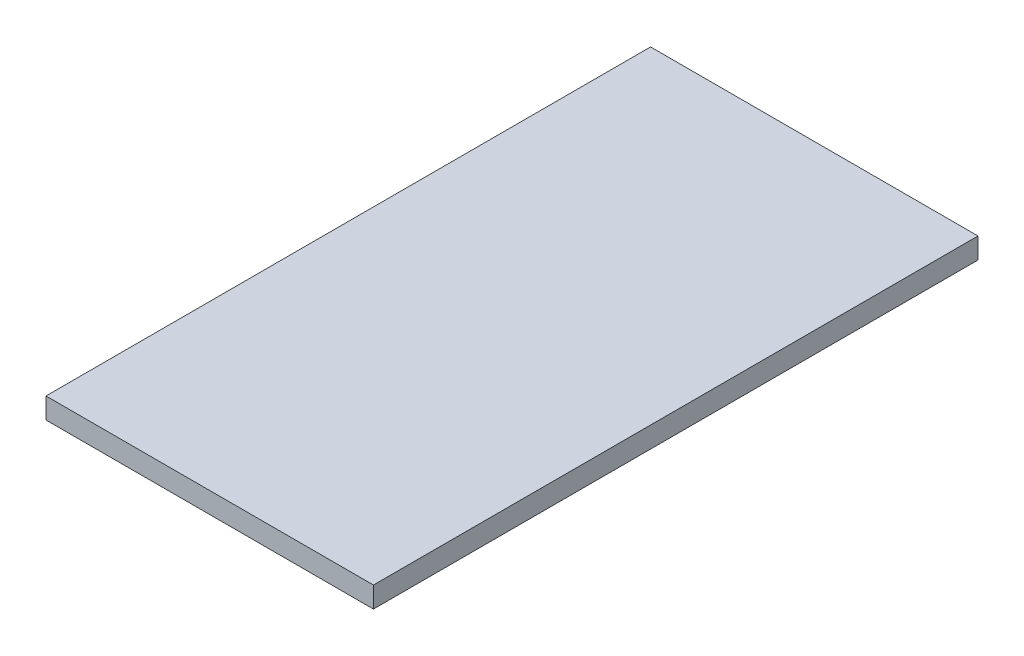
ISO-10303-21;
HEADER;
FILE_DESCRIPTION(('STEP AP214'),'2;1');
FILE_NAME('part.step','',(''),(''),'','','');
FILE_SCHEMA(('AUTOMOTIVE_DESIGN { 1 0 10303 214 1 1 1 1 }'));
ENDSEC;
DATA;
#1=APPLICATION_CONTEXT('core data for automotive mechanical design processes');
#2=APPLICATION_PROTOCOL_DEFINITION('international standard','automotive_design',2000,#1);
#3=PRODUCT_CONTEXT('',#1,'mechanical');
#4=PRODUCT('Part','Part','',(#3));
#5=PRODUCT_RELATED_PRODUCT_CATEGORY('part','',(#4));
#6=PRODUCT_DEFINITION_FORMATION('','',#4);
#7=PRODUCT_DEFINITION_CONTEXT('part definition',#1,'design');
#8=PRODUCT_DEFINITION('design','',#6,#7);
#9=PRODUCT_DEFINITION_SHAPE('','',#8);
#10=(LENGTH_UNIT() NAMED_UNIT(*) SI_UNIT(.MILLI.,.METRE.));
#11=(NAMED_UNIT(*) PLANE_ANGLE_UNIT() SI_UNIT($,.RADIAN.));
#12=(NAMED_UNIT(*) SI_UNIT($,.STERADIAN.) SOLID_ANGLE_UNIT());
#13=UNCERTAINTY_MEASURE_WITH_UNIT(LENGTH_MEASURE(1.E-05),#10,'distance_accuracy_value','');
#14=(GEOMETRIC_REPRESENTATION_CONTEXT(3) GLOBAL_UNCERTAINTY_ASSIGNED_CONTEXT((#13)) GLOBAL_UNIT_ASSIGNED_CONTEXT((#10,
#11,#12)) REPRESENTATION_CONTEXT('',''));
#15=CARTESIAN_POINT('',(0.,0.,0.));
#16=DIRECTION('',(0.,0.,1.));
#17=DIRECTION('',(1.,0.,0.));
#18=AXIS2_PLACEMENT_3D('',#15,#16,#17);
#19=CARTESIAN_POINT('',(0.,-19.05,0.));
#20=DIRECTION('',(0.,0.,1.));
#21=DIRECTION('',(1.,0.,0.));
#22=AXIS2_PLACEMENT_3D('',#19,#20,#21);
#23=PLANE('',#22);
#24=DIRECTION('',(1.,0.,0.));
#25=VECTOR('',#24,1.);
#26=CARTESIAN_POINT('',(0.,0.,0.));
#27=LINE('',#26,#25);
#28=CARTESIAN_POINT('',(0.,0.,0.));
#29=VERTEX_POINT('',#28);
#30=CARTESIAN_POINT('',(299.212,0.,0.));
#31=VERTEX_POINT('',#30);
#32=EDGE_CURVE('E105',#29,#31,#27,.T.);
#33=ORIENTED_EDGE('',*,*,#32,.F.);
#34=DIRECTION('',(0.,1.,0.));
#35=VECTOR('',#34,1.);
#36=CARTESIAN_POINT('',(0.,-19.05,0.));
#37=LINE('',#36,#35);
#38=CARTESIAN_POINT('',(0.,-19.05,0.));
#39=VERTEX_POINT('',#38);
#40=EDGE_CURVE('E11',#39,#29,#37,.T.);
#41=ORIENTED_EDGE('',*,*,#40,.F.);
#42=DIRECTION('',(1.,0.,0.));
#43=VECTOR('',#42,1.);
#44=CARTESIAN_POINT('',(0.,-19.05,0.));
#45=LINE('',#44,#43);
#46=CARTESIAN_POINT('',(299.212,-19.05,0.));
#47=VERTEX_POINT('',#46);
#48=EDGE_CURVE('E99',#39,#47,#45,.T.);
#49=ORIENTED_EDGE('',*,*,#48,.T.);
#50=DIRECTION('',(0.,1.,0.));
#51=VECTOR('',#50,1.);
#52=CARTESIAN_POINT('',(299.212,-19.05,0.));
#53=LINE('',#52,#51);
#54=EDGE_CURVE('E44',#47,#31,#53,.T.);
#55=ORIENTED_EDGE('',*,*,#54,.T.);
#56=EDGE_LOOP('',(#33,#41,#49,#55));
#57=FACE_BOUND('',#56,.T.);
#58=ADVANCED_FACE('F41',(#57),#23,.T.);
#59=CARTESIAN_POINT('',(0.,-19.05,-552.45));
#60=DIRECTION('',(-1.,0.,0.));
#61=DIRECTION('',(0.,0.,1.));
#62=AXIS2_PLACEMENT_3D('',#59,#60,#61);
#63=PLANE('',#62);
#64=DIRECTION('',(0.,0.,1.));
#65=VECTOR('',#64,1.);
#66=CARTESIAN_POINT('',(0.,0.,-552.45));
#67=LINE('',#66,#65);
#68=CARTESIAN_POINT('',(0.,0.,-552.45));
#69=VERTEX_POINT('',#68);
#70=EDGE_CURVE('E101',#69,#29,#67,.T.);
#71=ORIENTED_EDGE('',*,*,#70,.F.);
#72=DIRECTION('',(0.,1.,0.));
#73=VECTOR('',#72,1.);
#74=CARTESIAN_POINT('',(0.,-19.05,-552.45));
#75=LINE('',#74,#73);
#76=CARTESIAN_POINT('',(0.,-19.05,-552.45));
#77=VERTEX_POINT('',#76);
#78=EDGE_CURVE('E50',#77,#69,#75,.T.);
#79=ORIENTED_EDGE('',*,*,#78,.F.);
#80=DIRECTION('',(0.,0.,1.));
#81=VECTOR('',#80,1.);
#82=CARTESIAN_POINT('',(0.,-19.05,-552.45));
#83=LINE('',#82,#81);
#84=EDGE_CURVE('E96',#77,#39,#83,.T.);
#85=ORIENTED_EDGE('',*,*,#84,.T.);
#86=ORIENTED_EDGE('',*,*,#40,.T.);
#87=EDGE_LOOP('',(#71,#79,#85,#86));
#88=FACE_BOUND('',#87,.T.);
#89=ADVANCED_FACE('F115',(#88),#63,.T.);
#90=CARTESIAN_POINT('',(299.212,-19.05,-552.45));
#91=DIRECTION('',(0.,0.,-1.));
#92=DIRECTION('',(-1.,0.,0.));
#93=AXIS2_PLACEMENT_3D('',#90,#91,#92);
#94=PLANE('',#93);
#95=DIRECTION('',(-1.,0.,0.));
#96=VECTOR('',#95,1.);
#97=CARTESIAN_POINT('',(299.212,0.,-552.45));
#98=LINE('',#97,#96);
#99=CARTESIAN_POINT('',(299.212,0.,-552.45));
#100=VERTEX_POINT('',#99);
#101=EDGE_CURVE('E91',#100,#69,#98,.T.);
#102=ORIENTED_EDGE('',*,*,#101,.F.);
#103=DIRECTION('',(0.,1.,0.));
#104=VECTOR('',#103,1.);
#105=CARTESIAN_POINT('',(299.212,-19.05,-552.45));
#106=LINE('',#105,#104);
#107=CARTESIAN_POINT('',(299.212,-19.05,-552.45));
#108=VERTEX_POINT('',#107);
#109=EDGE_CURVE('E86',#108,#100,#106,.T.);
#110=ORIENTED_EDGE('',*,*,#109,.F.);
#111=DIRECTION('',(-1.,0.,0.));
#112=VECTOR('',#111,1.);
#113=CARTESIAN_POINT('',(299.212,-19.05,-552.45));
#114=LINE('',#113,#112);
#115=EDGE_CURVE('E89',#108,#77,#114,.T.);
#116=ORIENTED_EDGE('',*,*,#115,.T.);
#117=ORIENTED_EDGE('',*,*,#78,.T.);
#118=EDGE_LOOP('',(#102,#110,#116,#117));
#119=FACE_BOUND('',#118,.T.);
#120=ADVANCED_FACE('F88',(#119),#94,.T.);
#121=CARTESIAN_POINT('',(299.212,-19.05,0.));
#122=DIRECTION('',(1.,0.,0.));
#123=DIRECTION('',(0.,0.,-1.));
#124=AXIS2_PLACEMENT_3D('',#121,#122,#123);
#125=PLANE('',#124);
#126=DIRECTION('',(0.,0.,-1.));
#127=VECTOR('',#126,1.);
#128=CARTESIAN_POINT('',(299.212,0.,0.));
#129=LINE('',#128,#127);
#130=EDGE_CURVE('E108',#31,#100,#129,.T.);
#131=ORIENTED_EDGE('',*,*,#130,.F.);
#132=ORIENTED_EDGE('',*,*,#54,.F.);
#133=DIRECTION('',(0.,0.,-1.));
#134=VECTOR('',#133,1.);
#135=CARTESIAN_POINT('',(299.212,-19.05,0.));
#136=LINE('',#135,#134);
#137=EDGE_CURVE('E95',#47,#108,#136,.T.);
#138=ORIENTED_EDGE('',*,*,#137,.T.);
#139=ORIENTED_EDGE('',*,*,#109,.T.);
#140=EDGE_LOOP('',(#131,#132,#138,#139));
#141=FACE_BOUND('',#140,.T.);
#142=ADVANCED_FACE('F98',(#141),#125,.T.);
#143=CARTESIAN_POINT('',(0.,-19.05,0.));
#144=DIRECTION('',(0.,1.,0.));
#145=DIRECTION('',(0.,0.,1.));
#146=AXIS2_PLACEMENT_3D('',#143,#144,#145);
#147=PLANE('',#146);
#148=ORIENTED_EDGE('',*,*,#48,.F.);
#149=ORIENTED_EDGE('',*,*,#84,.F.);
#150=ORIENTED_EDGE('',*,*,#115,.F.);
#151=ORIENTED_EDGE('',*,*,#137,.F.);
#152=EDGE_LOOP('',(#148,#149,#150,#151));
#153=FACE_BOUND('',#152,.T.);
#154=ADVANCED_FACE('F94',(#153),#147,.F.);
#155=CARTESIAN_POINT('',(0.,0.,0.));
#156=DIRECTION('',(0.,1.,0.));
#157=DIRECTION('',(0.,0.,1.));
#158=AXIS2_PLACEMENT_3D('',#155,#156,#157);
#159=PLANE('',#158);
#160=ORIENTED_EDGE('',*,*,#32,.T.);
#161=ORIENTED_EDGE('',*,*,#130,.T.);
#162=ORIENTED_EDGE('',*,*,#101,.T.);
#163=ORIENTED_EDGE('',*,*,#70,.T.);
#164=EDGE_LOOP('',(#160,#161,#162,#163));
#165=FACE_BOUND('',#164,.T.);
#166=ADVANCED_FACE('F114',(#165),#159,.T.);
#167=CLOSED_SHELL('',(#58,#89,#120,#142,#154,#166));
#168=MANIFOLD_SOLID_BREP('B2',#167);
#169=ADVANCED_BREP_SHAPE_REPRESENTATION('',(#18,#168),#14);
#170=SHAPE_DEFINITION_REPRESENTATION(#9,#169);
ENDSEC;
END-ISO-10303-21;
